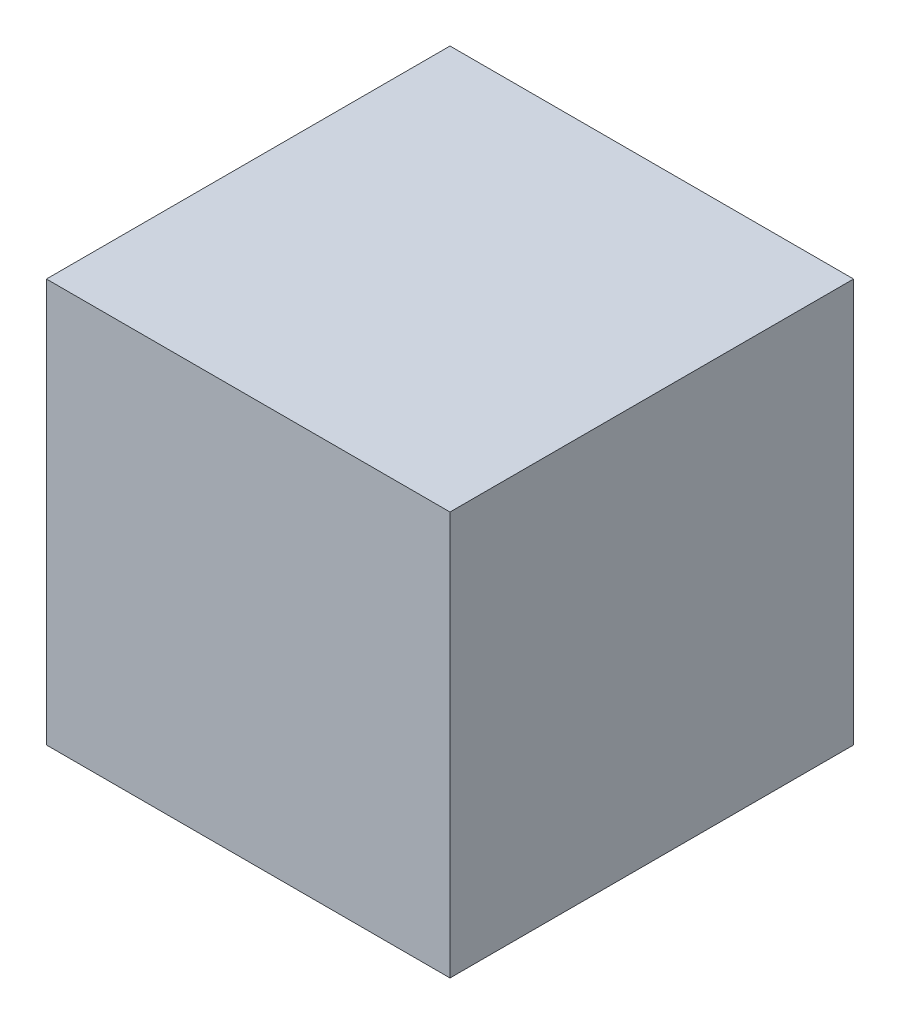
ISO-10303-21;
HEADER;
FILE_DESCRIPTION(('STEP AP214'),'2;1');
FILE_NAME('part.step','',(''),(''),'','','');
FILE_SCHEMA(('AUTOMOTIVE_DESIGN { 1 0 10303 214 1 1 1 1 }'));
ENDSEC;
DATA;
#1=APPLICATION_CONTEXT('core data for automotive mechanical design processes');
#2=APPLICATION_PROTOCOL_DEFINITION('international standard','automotive_design',2000,#1);
#3=PRODUCT_CONTEXT('',#1,'mechanical');
#4=PRODUCT('Part','Part','',(#3));
#5=PRODUCT_RELATED_PRODUCT_CATEGORY('part','',(#4));
#6=PRODUCT_DEFINITION_FORMATION('','',#4);
#7=PRODUCT_DEFINITION_CONTEXT('part definition',#1,'design');
#8=PRODUCT_DEFINITION('design','',#6,#7);
#9=PRODUCT_DEFINITION_SHAPE('','',#8);
#10=(LENGTH_UNIT() NAMED_UNIT(*) SI_UNIT(.MILLI.,.METRE.));
#11=(NAMED_UNIT(*) PLANE_ANGLE_UNIT() SI_UNIT($,.RADIAN.));
#12=(NAMED_UNIT(*) SI_UNIT($,.STERADIAN.) SOLID_ANGLE_UNIT());
#13=UNCERTAINTY_MEASURE_WITH_UNIT(LENGTH_MEASURE(1.E-05),#10,'distance_accuracy_value','');
#14=(GEOMETRIC_REPRESENTATION_CONTEXT(3) GLOBAL_UNCERTAINTY_ASSIGNED_CONTEXT((#13)) GLOBAL_UNIT_ASSIGNED_CONTEXT((#10,
#11,#12)) REPRESENTATION_CONTEXT('',''));
#15=CARTESIAN_POINT('',(0.,0.,0.));
#16=DIRECTION('',(0.,0.,1.));
#17=DIRECTION('',(1.,0.,0.));
#18=AXIS2_PLACEMENT_3D('',#15,#16,#17);
#19=CARTESIAN_POINT('',(0.,139.7,0.));
#20=DIRECTION('',(-1.,0.,0.));
#21=DIRECTION('',(0.,0.,1.));
#22=AXIS2_PLACEMENT_3D('',#19,#20,#21);
#23=PLANE('',#22);
#24=DIRECTION('',(0.,0.,-1.));
#25=VECTOR('',#24,1.);
#26=CARTESIAN_POINT('',(0.,0.,0.));
#27=LINE('',#26,#25);
#28=CARTESIAN_POINT('',(0.,0.,0.));
#29=VERTEX_POINT('',#28);
#30=CARTESIAN_POINT('',(0.,0.,-139.7));
#31=VERTEX_POINT('',#30);
#32=EDGE_CURVE('E95',#29,#31,#27,.T.);
#33=ORIENTED_EDGE('',*,*,#32,.T.);
#34=DIRECTION('',(0.,-1.,0.));
#35=VECTOR('',#34,1.);
#36=CARTESIAN_POINT('',(0.,139.7,-139.7));
#37=LINE('',#36,#35);
#38=CARTESIAN_POINT('',(0.,139.7,-139.7));
#39=VERTEX_POINT('',#38);
#40=EDGE_CURVE('E11',#39,#31,#37,.T.);
#41=ORIENTED_EDGE('',*,*,#40,.F.);
#42=DIRECTION('',(0.,0.,-1.));
#43=VECTOR('',#42,1.);
#44=CARTESIAN_POINT('',(0.,139.7,0.));
#45=LINE('',#44,#43);
#46=CARTESIAN_POINT('',(0.,139.7,0.));
#47=VERTEX_POINT('',#46);
#48=EDGE_CURVE('E83',#47,#39,#45,.T.);
#49=ORIENTED_EDGE('',*,*,#48,.F.);
#50=DIRECTION('',(0.,-1.,0.));
#51=VECTOR('',#50,1.);
#52=CARTESIAN_POINT('',(0.,139.7,0.));
#53=LINE('',#52,#51);
#54=EDGE_CURVE('E91',#47,#29,#53,.T.);
#55=ORIENTED_EDGE('',*,*,#54,.T.);
#56=EDGE_LOOP('',(#33,#41,#49,#55));
#57=FACE_BOUND('',#56,.T.);
#58=ADVANCED_FACE('F32',(#57),#23,.F.);
#59=CARTESIAN_POINT('',(0.,139.7,-139.7));
#60=DIRECTION('',(0.,0.,1.));
#61=DIRECTION('',(1.,0.,0.));
#62=AXIS2_PLACEMENT_3D('',#59,#60,#61);
#63=PLANE('',#62);
#64=DIRECTION('',(-1.,0.,0.));
#65=VECTOR('',#64,1.);
#66=CARTESIAN_POINT('',(0.,0.,-139.7));
#67=LINE('',#66,#65);
#68=CARTESIAN_POINT('',(-139.7,0.,-139.7));
#69=VERTEX_POINT('',#68);
#70=EDGE_CURVE('E87',#31,#69,#67,.T.);
#71=ORIENTED_EDGE('',*,*,#70,.T.);
#72=DIRECTION('',(0.,-1.,0.));
#73=VECTOR('',#72,1.);
#74=CARTESIAN_POINT('',(-139.7,139.7,-139.7));
#75=LINE('',#74,#73);
#76=CARTESIAN_POINT('',(-139.7,139.7,-139.7));
#77=VERTEX_POINT('',#76);
#78=EDGE_CURVE('E40',#77,#69,#75,.T.);
#79=ORIENTED_EDGE('',*,*,#78,.F.);
#80=DIRECTION('',(-1.,0.,0.));
#81=VECTOR('',#80,1.);
#82=CARTESIAN_POINT('',(0.,139.7,-139.7));
#83=LINE('',#82,#81);
#84=EDGE_CURVE('E78',#39,#77,#83,.T.);
#85=ORIENTED_EDGE('',*,*,#84,.F.);
#86=ORIENTED_EDGE('',*,*,#40,.T.);
#87=EDGE_LOOP('',(#71,#79,#85,#86));
#88=FACE_BOUND('',#87,.T.);
#89=ADVANCED_FACE('F86',(#88),#63,.F.);
#90=CARTESIAN_POINT('',(-139.7,139.7,0.));
#91=DIRECTION('',(1.,0.,0.));
#92=DIRECTION('',(0.,0.,-1.));
#93=AXIS2_PLACEMENT_3D('',#90,#91,#92);
#94=PLANE('',#93);
#95=DIRECTION('',(0.,0.,1.));
#96=VECTOR('',#95,1.);
#97=CARTESIAN_POINT('',(-139.7,0.,0.));
#98=LINE('',#97,#96);
#99=CARTESIAN_POINT('',(-139.7,0.,0.));
#100=VERTEX_POINT('',#99);
#101=EDGE_CURVE('E65',#69,#100,#98,.T.);
#102=ORIENTED_EDGE('',*,*,#101,.T.);
#103=DIRECTION('',(0.,-1.,0.));
#104=VECTOR('',#103,1.);
#105=CARTESIAN_POINT('',(-139.7,139.7,0.));
#106=LINE('',#105,#104);
#107=CARTESIAN_POINT('',(-139.7,139.7,0.));
#108=VERTEX_POINT('',#107);
#109=EDGE_CURVE('E88',#108,#100,#106,.T.);
#110=ORIENTED_EDGE('',*,*,#109,.F.);
#111=DIRECTION('',(0.,0.,1.));
#112=VECTOR('',#111,1.);
#113=CARTESIAN_POINT('',(-139.7,139.7,0.));
#114=LINE('',#113,#112);
#115=EDGE_CURVE('E81',#77,#108,#114,.T.);
#116=ORIENTED_EDGE('',*,*,#115,.F.);
#117=ORIENTED_EDGE('',*,*,#78,.T.);
#118=EDGE_LOOP('',(#102,#110,#116,#117));
#119=FACE_BOUND('',#118,.T.);
#120=ADVANCED_FACE('F89',(#119),#94,.F.);
#121=CARTESIAN_POINT('',(0.,139.7,0.));
#122=DIRECTION('',(0.,0.,-1.));
#123=DIRECTION('',(-1.,0.,0.));
#124=AXIS2_PLACEMENT_3D('',#121,#122,#123);
#125=PLANE('',#124);
#126=DIRECTION('',(1.,0.,0.));
#127=VECTOR('',#126,1.);
#128=CARTESIAN_POINT('',(0.,0.,0.));
#129=LINE('',#128,#127);
#130=EDGE_CURVE('E71',#100,#29,#129,.T.);
#131=ORIENTED_EDGE('',*,*,#130,.T.);
#132=ORIENTED_EDGE('',*,*,#54,.F.);
#133=DIRECTION('',(1.,0.,0.));
#134=VECTOR('',#133,1.);
#135=CARTESIAN_POINT('',(0.,139.7,0.));
#136=LINE('',#135,#134);
#137=EDGE_CURVE('E48',#108,#47,#136,.T.);
#138=ORIENTED_EDGE('',*,*,#137,.F.);
#139=ORIENTED_EDGE('',*,*,#109,.T.);
#140=EDGE_LOOP('',(#131,#132,#138,#139));
#141=FACE_BOUND('',#140,.T.);
#142=ADVANCED_FACE('F102',(#141),#125,.F.);
#143=CARTESIAN_POINT('',(0.,139.7,0.));
#144=DIRECTION('',(0.,1.,0.));
#145=DIRECTION('',(0.,0.,1.));
#146=AXIS2_PLACEMENT_3D('',#143,#144,#145);
#147=PLANE('',#146);
#148=ORIENTED_EDGE('',*,*,#48,.T.);
#149=ORIENTED_EDGE('',*,*,#84,.T.);
#150=ORIENTED_EDGE('',*,*,#115,.T.);
#151=ORIENTED_EDGE('',*,*,#137,.T.);
#152=EDGE_LOOP('',(#148,#149,#150,#151));
#153=FACE_BOUND('',#152,.T.);
#154=ADVANCED_FACE('F79',(#153),#147,.T.);
#155=CARTESIAN_POINT('',(0.,0.,0.));
#156=DIRECTION('',(0.,1.,0.));
#157=DIRECTION('',(0.,0.,1.));
#158=AXIS2_PLACEMENT_3D('',#155,#156,#157);
#159=PLANE('',#158);
#160=ORIENTED_EDGE('',*,*,#32,.F.);
#161=ORIENTED_EDGE('',*,*,#130,.F.);
#162=ORIENTED_EDGE('',*,*,#101,.F.);
#163=ORIENTED_EDGE('',*,*,#70,.F.);
#164=EDGE_LOOP('',(#160,#161,#162,#163));
#165=FACE_BOUND('',#164,.T.);
#166=ADVANCED_FACE('F105',(#165),#159,.F.);
#167=CLOSED_SHELL('',(#58,#89,#120,#142,#154,#166));
#168=MANIFOLD_SOLID_BREP('B2',#167);
#169=ADVANCED_BREP_SHAPE_REPRESENTATION('',(#18,#168),#14);
#170=SHAPE_DEFINITION_REPRESENTATION(#9,#169);
ENDSEC;
END-ISO-10303-21;
